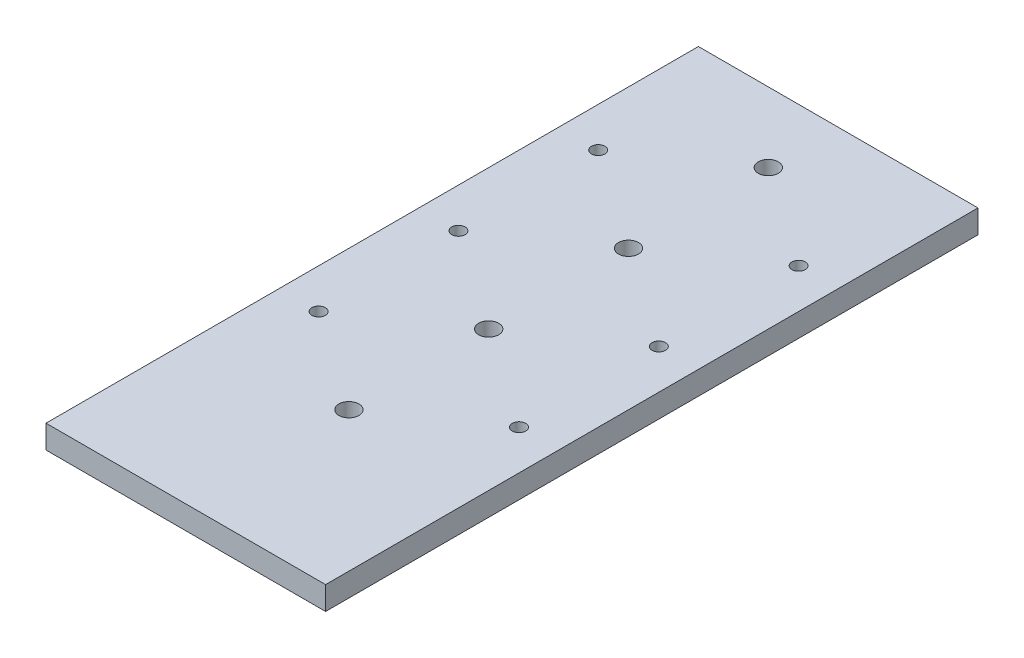
ISO-10303-21;
HEADER;
FILE_DESCRIPTION(('STEP AP214'),'2;1');
FILE_NAME('part.step','',(''),(''),'','','');
FILE_SCHEMA(('AUTOMOTIVE_DESIGN { 1 0 10303 214 1 1 1 1 }'));
ENDSEC;
DATA;
#1=APPLICATION_CONTEXT('core data for automotive mechanical design processes');
#2=APPLICATION_PROTOCOL_DEFINITION('international standard','automotive_design',2000,#1);
#3=PRODUCT_CONTEXT('',#1,'mechanical');
#4=PRODUCT('Part','Part','',(#3));
#5=PRODUCT_RELATED_PRODUCT_CATEGORY('part','',(#4));
#6=PRODUCT_DEFINITION_FORMATION('','',#4);
#7=PRODUCT_DEFINITION_CONTEXT('part definition',#1,'design');
#8=PRODUCT_DEFINITION('design','',#6,#7);
#9=PRODUCT_DEFINITION_SHAPE('','',#8);
#10=(LENGTH_UNIT() NAMED_UNIT(*) SI_UNIT(.MILLI.,.METRE.));
#11=(NAMED_UNIT(*) PLANE_ANGLE_UNIT() SI_UNIT($,.RADIAN.));
#12=(NAMED_UNIT(*) SI_UNIT($,.STERADIAN.) SOLID_ANGLE_UNIT());
#13=UNCERTAINTY_MEASURE_WITH_UNIT(LENGTH_MEASURE(1.E-05),#10,'distance_accuracy_value','');
#14=(GEOMETRIC_REPRESENTATION_CONTEXT(3) GLOBAL_UNCERTAINTY_ASSIGNED_CONTEXT((#13)) GLOBAL_UNIT_ASSIGNED_CONTEXT((#10,
#11,#12)) REPRESENTATION_CONTEXT('',''));
#15=CARTESIAN_POINT('',(0.,0.,0.));
#16=DIRECTION('',(0.,0.,1.));
#17=DIRECTION('',(1.,0.,0.));
#18=AXIS2_PLACEMENT_3D('',#15,#16,#17);
#19=CARTESIAN_POINT('',(38.1,-6.35,-88.9));
#20=DIRECTION('',(1.,0.,0.));
#21=DIRECTION('',(0.,0.,-1.));
#22=AXIS2_PLACEMENT_3D('',#19,#20,#21);
#23=PLANE('',#22);
#24=DIRECTION('',(0.,0.,-1.));
#25=VECTOR('',#24,1.);
#26=CARTESIAN_POINT('',(38.1,0.,-88.9));
#27=LINE('',#26,#25);
#28=CARTESIAN_POINT('',(38.1,0.,88.9));
#29=VERTEX_POINT('',#28);
#30=CARTESIAN_POINT('',(38.1,0.,-88.9));
#31=VERTEX_POINT('',#30);
#32=EDGE_CURVE('E98',#29,#31,#27,.T.);
#33=ORIENTED_EDGE('',*,*,#32,.F.);
#34=DIRECTION('',(0.,1.,0.));
#35=VECTOR('',#34,1.);
#36=CARTESIAN_POINT('',(38.1,-6.35,88.9));
#37=LINE('',#36,#35);
#38=CARTESIAN_POINT('',(38.1,-6.35,88.9));
#39=VERTEX_POINT('',#38);
#40=EDGE_CURVE('E11',#39,#29,#37,.T.);
#41=ORIENTED_EDGE('',*,*,#40,.F.);
#42=DIRECTION('',(0.,0.,-1.));
#43=VECTOR('',#42,1.);
#44=CARTESIAN_POINT('',(38.1,-6.35,-88.9));
#45=LINE('',#44,#43);
#46=CARTESIAN_POINT('',(38.1,-6.35,-88.9));
#47=VERTEX_POINT('',#46);
#48=EDGE_CURVE('E91',#39,#47,#45,.T.);
#49=ORIENTED_EDGE('',*,*,#48,.T.);
#50=DIRECTION('',(0.,1.,0.));
#51=VECTOR('',#50,1.);
#52=CARTESIAN_POINT('',(38.1,-6.35,-88.9));
#53=LINE('',#52,#51);
#54=EDGE_CURVE('E36',#47,#31,#53,.T.);
#55=ORIENTED_EDGE('',*,*,#54,.T.);
#56=EDGE_LOOP('',(#33,#41,#49,#55));
#57=FACE_BOUND('',#56,.T.);
#58=ADVANCED_FACE('F33',(#57),#23,.T.);
#59=CARTESIAN_POINT('',(-38.0999999999999,-6.35,88.9));
#60=DIRECTION('',(0.,0.,1.));
#61=DIRECTION('',(1.,0.,0.));
#62=AXIS2_PLACEMENT_3D('',#59,#60,#61);
#63=PLANE('',#62);
#64=DIRECTION('',(1.,0.,0.));
#65=VECTOR('',#64,1.);
#66=CARTESIAN_POINT('',(-38.0999999999999,0.,88.9));
#67=LINE('',#66,#65);
#68=CARTESIAN_POINT('',(-38.0999999999999,0.,88.9));
#69=VERTEX_POINT('',#68);
#70=EDGE_CURVE('E93',#69,#29,#67,.T.);
#71=ORIENTED_EDGE('',*,*,#70,.F.);
#72=DIRECTION('',(0.,1.,0.));
#73=VECTOR('',#72,1.);
#74=CARTESIAN_POINT('',(-38.0999999999999,-6.35,88.9));
#75=LINE('',#74,#73);
#76=CARTESIAN_POINT('',(-38.0999999999999,-6.35,88.9));
#77=VERTEX_POINT('',#76);
#78=EDGE_CURVE('E42',#77,#69,#75,.T.);
#79=ORIENTED_EDGE('',*,*,#78,.F.);
#80=DIRECTION('',(1.,0.,0.));
#81=VECTOR('',#80,1.);
#82=CARTESIAN_POINT('',(-38.0999999999999,-6.35,88.9));
#83=LINE('',#82,#81);
#84=EDGE_CURVE('E88',#77,#39,#83,.T.);
#85=ORIENTED_EDGE('',*,*,#84,.T.);
#86=ORIENTED_EDGE('',*,*,#40,.T.);
#87=EDGE_LOOP('',(#71,#79,#85,#86));
#88=FACE_BOUND('',#87,.T.);
#89=ADVANCED_FACE('F109',(#88),#63,.T.);
#90=CARTESIAN_POINT('',(-38.1,-6.35,-88.9));
#91=DIRECTION('',(-1.,0.,0.));
#92=DIRECTION('',(0.,0.,1.));
#93=AXIS2_PLACEMENT_3D('',#90,#91,#92);
#94=PLANE('',#93);
#95=DIRECTION('',(0.,0.,1.));
#96=VECTOR('',#95,1.);
#97=CARTESIAN_POINT('',(-38.1,0.,-88.9));
#98=LINE('',#97,#96);
#99=CARTESIAN_POINT('',(-38.1,0.,-88.9));
#100=VERTEX_POINT('',#99);
#101=EDGE_CURVE('E83',#100,#69,#98,.T.);
#102=ORIENTED_EDGE('',*,*,#101,.F.);
#103=DIRECTION('',(0.,1.,0.));
#104=VECTOR('',#103,1.);
#105=CARTESIAN_POINT('',(-38.1,-6.35,-88.9));
#106=LINE('',#105,#104);
#107=CARTESIAN_POINT('',(-38.1,-6.35,-88.9));
#108=VERTEX_POINT('',#107);
#109=EDGE_CURVE('E78',#108,#100,#106,.T.);
#110=ORIENTED_EDGE('',*,*,#109,.F.);
#111=DIRECTION('',(0.,0.,1.));
#112=VECTOR('',#111,1.);
#113=CARTESIAN_POINT('',(-38.1,-6.35,-88.9));
#114=LINE('',#113,#112);
#115=EDGE_CURVE('E81',#108,#77,#114,.T.);
#116=ORIENTED_EDGE('',*,*,#115,.T.);
#117=ORIENTED_EDGE('',*,*,#78,.T.);
#118=EDGE_LOOP('',(#102,#110,#116,#117));
#119=FACE_BOUND('',#118,.T.);
#120=ADVANCED_FACE('F80',(#119),#94,.T.);
#121=CARTESIAN_POINT('',(-38.1,-6.35,-88.9));
#122=DIRECTION('',(0.,0.,-1.));
#123=DIRECTION('',(-1.,0.,0.));
#124=AXIS2_PLACEMENT_3D('',#121,#122,#123);
#125=PLANE('',#124);
#126=DIRECTION('',(-1.,0.,0.));
#127=VECTOR('',#126,1.);
#128=CARTESIAN_POINT('',(-38.1,0.,-88.9));
#129=LINE('',#128,#127);
#130=EDGE_CURVE('E101',#31,#100,#129,.T.);
#131=ORIENTED_EDGE('',*,*,#130,.F.);
#132=ORIENTED_EDGE('',*,*,#54,.F.);
#133=DIRECTION('',(-1.,0.,0.));
#134=VECTOR('',#133,1.);
#135=CARTESIAN_POINT('',(-38.1,-6.35,-88.9));
#136=LINE('',#135,#134);
#137=EDGE_CURVE('E87',#47,#108,#136,.T.);
#138=ORIENTED_EDGE('',*,*,#137,.T.);
#139=ORIENTED_EDGE('',*,*,#109,.T.);
#140=EDGE_LOOP('',(#131,#132,#138,#139));
#141=FACE_BOUND('',#140,.T.);
#142=ADVANCED_FACE('F90',(#141),#125,.T.);
#143=CARTESIAN_POINT('',(0.,-6.35,0.));
#144=DIRECTION('',(0.,1.,0.));
#145=DIRECTION('',(0.,0.,1.));
#146=AXIS2_PLACEMENT_3D('',#143,#144,#145);
#147=PLANE('',#146);
#148=CARTESIAN_POINT('',(-27.305,-6.35,-50.8));
#149=DIRECTION('',(0.,1.,0.));
#150=DIRECTION('',(0.,0.,1.));
#151=AXIS2_PLACEMENT_3D('',#148,#149,#150);
#152=CIRCLE('',#151,1.8288);
#153=CARTESIAN_POINT('',(-27.305,-6.35,-48.9712));
#154=VERTEX_POINT('',#153);
#155=EDGE_CURVE('E174',#154,#154,#152,.T.);
#156=ORIENTED_EDGE('',*,*,#155,.T.);
#157=EDGE_LOOP('',(#156));
#158=FACE_BOUND('',#157,.T.);
#159=CARTESIAN_POINT('',(-27.305,-6.35,25.4));
#160=DIRECTION('',(0.,1.,0.));
#161=DIRECTION('',(0.,0.,1.));
#162=AXIS2_PLACEMENT_3D('',#159,#160,#161);
#163=CIRCLE('',#162,1.8288);
#164=CARTESIAN_POINT('',(-27.305,-6.35,27.2288));
#165=VERTEX_POINT('',#164);
#166=EDGE_CURVE('E182',#165,#165,#163,.T.);
#167=ORIENTED_EDGE('',*,*,#166,.T.);
#168=EDGE_LOOP('',(#167));
#169=FACE_BOUND('',#168,.T.);
#170=CARTESIAN_POINT('',(-27.305,-6.35,-12.7));
#171=DIRECTION('',(0.,1.,0.));
#172=DIRECTION('',(0.,0.,1.));
#173=AXIS2_PLACEMENT_3D('',#170,#171,#172);
#174=CIRCLE('',#173,1.8288);
#175=CARTESIAN_POINT('',(-27.305,-6.35,-10.8712));
#176=VERTEX_POINT('',#175);
#177=EDGE_CURVE('E188',#176,#176,#174,.T.);
#178=ORIENTED_EDGE('',*,*,#177,.T.);
#179=EDGE_LOOP('',(#178));
#180=FACE_BOUND('',#179,.T.);
#181=CARTESIAN_POINT('',(27.305,-6.35,25.4));
#182=DIRECTION('',(0.,1.,0.));
#183=DIRECTION('',(0.,0.,1.));
#184=AXIS2_PLACEMENT_3D('',#181,#182,#183);
#185=CIRCLE('',#184,1.8288);
#186=CARTESIAN_POINT('',(27.305,-6.35,27.2288));
#187=VERTEX_POINT('',#186);
#188=EDGE_CURVE('E194',#187,#187,#185,.T.);
#189=ORIENTED_EDGE('',*,*,#188,.T.);
#190=EDGE_LOOP('',(#189));
#191=FACE_BOUND('',#190,.T.);
#192=CARTESIAN_POINT('',(27.305,-6.35,-12.7));
#193=DIRECTION('',(0.,1.,0.));
#194=DIRECTION('',(0.,0.,1.));
#195=AXIS2_PLACEMENT_3D('',#192,#193,#194);
#196=CIRCLE('',#195,1.8288);
#197=CARTESIAN_POINT('',(27.305,-6.35,-10.8712));
#198=VERTEX_POINT('',#197);
#199=EDGE_CURVE('E200',#198,#198,#196,.T.);
#200=ORIENTED_EDGE('',*,*,#199,.T.);
#201=EDGE_LOOP('',(#200));
#202=FACE_BOUND('',#201,.T.);
#203=CARTESIAN_POINT('',(0.,-6.35,44.45));
#204=DIRECTION('',(0.,1.,0.));
#205=DIRECTION('',(0.,0.,1.));
#206=AXIS2_PLACEMENT_3D('',#203,#204,#205);
#207=CIRCLE('',#206,2.7305);
#208=CARTESIAN_POINT('',(0.,-6.35,47.1805));
#209=VERTEX_POINT('',#208);
#210=EDGE_CURVE('E206',#209,#209,#207,.T.);
#211=ORIENTED_EDGE('',*,*,#210,.T.);
#212=EDGE_LOOP('',(#211));
#213=FACE_BOUND('',#212,.T.);
#214=CARTESIAN_POINT('',(0.,-6.35,6.34999999999998));
#215=DIRECTION('',(0.,1.,0.));
#216=DIRECTION('',(0.,0.,1.));
#217=AXIS2_PLACEMENT_3D('',#214,#215,#216);
#218=CIRCLE('',#217,2.7305);
#219=CARTESIAN_POINT('',(0.,-6.35,9.08049999999998));
#220=VERTEX_POINT('',#219);
#221=EDGE_CURVE('E212',#220,#220,#218,.T.);
#222=ORIENTED_EDGE('',*,*,#221,.T.);
#223=EDGE_LOOP('',(#222));
#224=FACE_BOUND('',#223,.T.);
#225=CARTESIAN_POINT('',(0.,-6.35,-31.75));
#226=DIRECTION('',(0.,1.,0.));
#227=DIRECTION('',(0.,0.,1.));
#228=AXIS2_PLACEMENT_3D('',#225,#226,#227);
#229=CIRCLE('',#228,2.7305);
#230=CARTESIAN_POINT('',(0.,-6.35,-29.0195));
#231=VERTEX_POINT('',#230);
#232=EDGE_CURVE('E218',#231,#231,#229,.T.);
#233=ORIENTED_EDGE('',*,*,#232,.T.);
#234=EDGE_LOOP('',(#233));
#235=FACE_BOUND('',#234,.T.);
#236=CARTESIAN_POINT('',(0.,-6.35,-69.85));
#237=DIRECTION('',(0.,1.,0.));
#238=DIRECTION('',(0.,0.,1.));
#239=AXIS2_PLACEMENT_3D('',#236,#237,#238);
#240=CIRCLE('',#239,2.7305);
#241=CARTESIAN_POINT('',(0.,-6.35,-67.1195));
#242=VERTEX_POINT('',#241);
#243=EDGE_CURVE('E224',#242,#242,#240,.T.);
#244=ORIENTED_EDGE('',*,*,#243,.T.);
#245=EDGE_LOOP('',(#244));
#246=FACE_BOUND('',#245,.T.);
#247=CARTESIAN_POINT('',(27.305,-6.35,-50.8));
#248=DIRECTION('',(0.,1.,0.));
#249=DIRECTION('',(0.,0.,1.));
#250=AXIS2_PLACEMENT_3D('',#247,#248,#249);
#251=CIRCLE('',#250,1.8288);
#252=CARTESIAN_POINT('',(27.305,-6.35,-48.9712));
#253=VERTEX_POINT('',#252);
#254=EDGE_CURVE('E102',#253,#253,#251,.T.);
#255=ORIENTED_EDGE('',*,*,#254,.T.);
#256=EDGE_LOOP('',(#255));
#257=FACE_BOUND('',#256,.T.);
#258=ORIENTED_EDGE('',*,*,#48,.F.);
#259=ORIENTED_EDGE('',*,*,#84,.F.);
#260=ORIENTED_EDGE('',*,*,#115,.F.);
#261=ORIENTED_EDGE('',*,*,#137,.F.);
#262=EDGE_LOOP('',(#258,#259,#260,#261));
#263=FACE_BOUND('',#262,.T.);
#264=ADVANCED_FACE('F86',(#158,#169,#180,#191,#202,#213,#224,#235,#246,#257,#263),#147,.F.);
#265=CARTESIAN_POINT('',(0.,0.,0.));
#266=DIRECTION('',(0.,1.,0.));
#267=DIRECTION('',(0.,0.,1.));
#268=AXIS2_PLACEMENT_3D('',#265,#266,#267);
#269=PLANE('',#268);
#270=CARTESIAN_POINT('',(-27.305,0.,-50.8));
#271=DIRECTION('',(0.,1.,0.));
#272=DIRECTION('',(0.,0.,1.));
#273=AXIS2_PLACEMENT_3D('',#270,#271,#272);
#274=CIRCLE('',#273,1.8288);
#275=CARTESIAN_POINT('',(-27.305,0.,-48.9712));
#276=VERTEX_POINT('',#275);
#277=EDGE_CURVE('E177',#276,#276,#274,.T.);
#278=ORIENTED_EDGE('',*,*,#277,.F.);
#279=EDGE_LOOP('',(#278));
#280=FACE_BOUND('',#279,.T.);
#281=CARTESIAN_POINT('',(-27.305,0.,25.4));
#282=DIRECTION('',(0.,1.,0.));
#283=DIRECTION('',(0.,0.,1.));
#284=AXIS2_PLACEMENT_3D('',#281,#282,#283);
#285=CIRCLE('',#284,1.8288);
#286=CARTESIAN_POINT('',(-27.305,0.,27.2288));
#287=VERTEX_POINT('',#286);
#288=EDGE_CURVE('E179',#287,#287,#285,.T.);
#289=ORIENTED_EDGE('',*,*,#288,.F.);
#290=EDGE_LOOP('',(#289));
#291=FACE_BOUND('',#290,.T.);
#292=CARTESIAN_POINT('',(-27.305,0.,-12.7));
#293=DIRECTION('',(0.,1.,0.));
#294=DIRECTION('',(0.,0.,1.));
#295=AXIS2_PLACEMENT_3D('',#292,#293,#294);
#296=CIRCLE('',#295,1.8288);
#297=CARTESIAN_POINT('',(-27.305,0.,-10.8712));
#298=VERTEX_POINT('',#297);
#299=EDGE_CURVE('E185',#298,#298,#296,.T.);
#300=ORIENTED_EDGE('',*,*,#299,.F.);
#301=EDGE_LOOP('',(#300));
#302=FACE_BOUND('',#301,.T.);
#303=CARTESIAN_POINT('',(27.305,0.,25.4));
#304=DIRECTION('',(0.,1.,0.));
#305=DIRECTION('',(0.,0.,1.));
#306=AXIS2_PLACEMENT_3D('',#303,#304,#305);
#307=CIRCLE('',#306,1.8288);
#308=CARTESIAN_POINT('',(27.305,0.,27.2288));
#309=VERTEX_POINT('',#308);
#310=EDGE_CURVE('E191',#309,#309,#307,.T.);
#311=ORIENTED_EDGE('',*,*,#310,.F.);
#312=EDGE_LOOP('',(#311));
#313=FACE_BOUND('',#312,.T.);
#314=CARTESIAN_POINT('',(27.305,0.,-12.7));
#315=DIRECTION('',(0.,1.,0.));
#316=DIRECTION('',(0.,0.,1.));
#317=AXIS2_PLACEMENT_3D('',#314,#315,#316);
#318=CIRCLE('',#317,1.8288);
#319=CARTESIAN_POINT('',(27.305,0.,-10.8712));
#320=VERTEX_POINT('',#319);
#321=EDGE_CURVE('E197',#320,#320,#318,.T.);
#322=ORIENTED_EDGE('',*,*,#321,.F.);
#323=EDGE_LOOP('',(#322));
#324=FACE_BOUND('',#323,.T.);
#325=CARTESIAN_POINT('',(0.,0.,44.45));
#326=DIRECTION('',(0.,1.,0.));
#327=DIRECTION('',(0.,0.,1.));
#328=AXIS2_PLACEMENT_3D('',#325,#326,#327);
#329=CIRCLE('',#328,2.7305);
#330=CARTESIAN_POINT('',(0.,0.,47.1805));
#331=VERTEX_POINT('',#330);
#332=EDGE_CURVE('E203',#331,#331,#329,.T.);
#333=ORIENTED_EDGE('',*,*,#332,.F.);
#334=EDGE_LOOP('',(#333));
#335=FACE_BOUND('',#334,.T.);
#336=CARTESIAN_POINT('',(0.,0.,6.34999999999998));
#337=DIRECTION('',(0.,1.,0.));
#338=DIRECTION('',(0.,0.,1.));
#339=AXIS2_PLACEMENT_3D('',#336,#337,#338);
#340=CIRCLE('',#339,2.7305);
#341=CARTESIAN_POINT('',(0.,0.,9.08049999999998));
#342=VERTEX_POINT('',#341);
#343=EDGE_CURVE('E209',#342,#342,#340,.T.);
#344=ORIENTED_EDGE('',*,*,#343,.F.);
#345=EDGE_LOOP('',(#344));
#346=FACE_BOUND('',#345,.T.);
#347=CARTESIAN_POINT('',(0.,0.,-31.75));
#348=DIRECTION('',(0.,1.,0.));
#349=DIRECTION('',(0.,0.,1.));
#350=AXIS2_PLACEMENT_3D('',#347,#348,#349);
#351=CIRCLE('',#350,2.7305);
#352=CARTESIAN_POINT('',(0.,0.,-29.0195));
#353=VERTEX_POINT('',#352);
#354=EDGE_CURVE('E215',#353,#353,#351,.T.);
#355=ORIENTED_EDGE('',*,*,#354,.F.);
#356=EDGE_LOOP('',(#355));
#357=FACE_BOUND('',#356,.T.);
#358=CARTESIAN_POINT('',(0.,0.,-69.85));
#359=DIRECTION('',(0.,1.,0.));
#360=DIRECTION('',(0.,0.,1.));
#361=AXIS2_PLACEMENT_3D('',#358,#359,#360);
#362=CIRCLE('',#361,2.7305);
#363=CARTESIAN_POINT('',(0.,0.,-67.1195));
#364=VERTEX_POINT('',#363);
#365=EDGE_CURVE('E221',#364,#364,#362,.T.);
#366=ORIENTED_EDGE('',*,*,#365,.F.);
#367=EDGE_LOOP('',(#366));
#368=FACE_BOUND('',#367,.T.);
#369=CARTESIAN_POINT('',(27.305,0.,-50.8));
#370=DIRECTION('',(0.,1.,0.));
#371=DIRECTION('',(0.,0.,1.));
#372=AXIS2_PLACEMENT_3D('',#369,#370,#371);
#373=CIRCLE('',#372,1.8288);
#374=CARTESIAN_POINT('',(27.305,0.,-48.9712));
#375=VERTEX_POINT('',#374);
#376=EDGE_CURVE('E227',#375,#375,#373,.T.);
#377=ORIENTED_EDGE('',*,*,#376,.F.);
#378=EDGE_LOOP('',(#377));
#379=FACE_BOUND('',#378,.T.);
#380=ORIENTED_EDGE('',*,*,#32,.T.);
#381=ORIENTED_EDGE('',*,*,#130,.T.);
#382=ORIENTED_EDGE('',*,*,#101,.T.);
#383=ORIENTED_EDGE('',*,*,#70,.T.);
#384=EDGE_LOOP('',(#380,#381,#382,#383));
#385=FACE_BOUND('',#384,.T.);
#386=ADVANCED_FACE('F108',(#280,#291,#302,#313,#324,#335,#346,#357,#368,#379,#385),#269,.T.);
#387=CARTESIAN_POINT('',(27.305,-6.35,-50.8));
#388=DIRECTION('',(0.,1.,0.));
#389=DIRECTION('',(0.,0.,1.));
#390=AXIS2_PLACEMENT_3D('',#387,#388,#389);
#391=CYLINDRICAL_SURFACE('',#390,1.8288);
#392=ORIENTED_EDGE('',*,*,#254,.F.);
#393=EDGE_LOOP('',(#392));
#394=FACE_BOUND('',#393,.T.);
#395=ORIENTED_EDGE('',*,*,#376,.T.);
#396=EDGE_LOOP('',(#395));
#397=FACE_BOUND('',#396,.T.);
#398=ADVANCED_FACE('F127',(#394,#397),#391,.F.);
#399=CARTESIAN_POINT('',(0.,-6.35,-69.85));
#400=DIRECTION('',(0.,1.,0.));
#401=DIRECTION('',(0.,0.,1.));
#402=AXIS2_PLACEMENT_3D('',#399,#400,#401);
#403=CYLINDRICAL_SURFACE('',#402,2.7305);
#404=ORIENTED_EDGE('',*,*,#243,.F.);
#405=EDGE_LOOP('',(#404));
#406=FACE_BOUND('',#405,.T.);
#407=ORIENTED_EDGE('',*,*,#365,.T.);
#408=EDGE_LOOP('',(#407));
#409=FACE_BOUND('',#408,.T.);
#410=ADVANCED_FACE('F134',(#406,#409),#403,.F.);
#411=CARTESIAN_POINT('',(0.,-6.35,-31.75));
#412=DIRECTION('',(0.,1.,0.));
#413=DIRECTION('',(0.,0.,1.));
#414=AXIS2_PLACEMENT_3D('',#411,#412,#413);
#415=CYLINDRICAL_SURFACE('',#414,2.7305);
#416=ORIENTED_EDGE('',*,*,#232,.F.);
#417=EDGE_LOOP('',(#416));
#418=FACE_BOUND('',#417,.T.);
#419=ORIENTED_EDGE('',*,*,#354,.T.);
#420=EDGE_LOOP('',(#419));
#421=FACE_BOUND('',#420,.T.);
#422=ADVANCED_FACE('F138',(#418,#421),#415,.F.);
#423=CARTESIAN_POINT('',(0.,-6.35,6.34999999999998));
#424=DIRECTION('',(0.,1.,0.));
#425=DIRECTION('',(0.,0.,1.));
#426=AXIS2_PLACEMENT_3D('',#423,#424,#425);
#427=CYLINDRICAL_SURFACE('',#426,2.7305);
#428=ORIENTED_EDGE('',*,*,#221,.F.);
#429=EDGE_LOOP('',(#428));
#430=FACE_BOUND('',#429,.T.);
#431=ORIENTED_EDGE('',*,*,#343,.T.);
#432=EDGE_LOOP('',(#431));
#433=FACE_BOUND('',#432,.T.);
#434=ADVANCED_FACE('F142',(#430,#433),#427,.F.);
#435=CARTESIAN_POINT('',(0.,-6.35,44.45));
#436=DIRECTION('',(0.,1.,0.));
#437=DIRECTION('',(0.,0.,1.));
#438=AXIS2_PLACEMENT_3D('',#435,#436,#437);
#439=CYLINDRICAL_SURFACE('',#438,2.7305);
#440=ORIENTED_EDGE('',*,*,#210,.F.);
#441=EDGE_LOOP('',(#440));
#442=FACE_BOUND('',#441,.T.);
#443=ORIENTED_EDGE('',*,*,#332,.T.);
#444=EDGE_LOOP('',(#443));
#445=FACE_BOUND('',#444,.T.);
#446=ADVANCED_FACE('F146',(#442,#445),#439,.F.);
#447=CARTESIAN_POINT('',(27.305,-6.35,-12.7));
#448=DIRECTION('',(0.,1.,0.));
#449=DIRECTION('',(0.,0.,1.));
#450=AXIS2_PLACEMENT_3D('',#447,#448,#449);
#451=CYLINDRICAL_SURFACE('',#450,1.8288);
#452=ORIENTED_EDGE('',*,*,#199,.F.);
#453=EDGE_LOOP('',(#452));
#454=FACE_BOUND('',#453,.T.);
#455=ORIENTED_EDGE('',*,*,#321,.T.);
#456=EDGE_LOOP('',(#455));
#457=FACE_BOUND('',#456,.T.);
#458=ADVANCED_FACE('F150',(#454,#457),#451,.F.);
#459=CARTESIAN_POINT('',(27.305,-6.35,25.4));
#460=DIRECTION('',(0.,1.,0.));
#461=DIRECTION('',(0.,0.,1.));
#462=AXIS2_PLACEMENT_3D('',#459,#460,#461);
#463=CYLINDRICAL_SURFACE('',#462,1.8288);
#464=ORIENTED_EDGE('',*,*,#188,.F.);
#465=EDGE_LOOP('',(#464));
#466=FACE_BOUND('',#465,.T.);
#467=ORIENTED_EDGE('',*,*,#310,.T.);
#468=EDGE_LOOP('',(#467));
#469=FACE_BOUND('',#468,.T.);
#470=ADVANCED_FACE('F154',(#466,#469),#463,.F.);
#471=CARTESIAN_POINT('',(-27.305,-6.35,-12.7));
#472=DIRECTION('',(0.,1.,0.));
#473=DIRECTION('',(0.,0.,1.));
#474=AXIS2_PLACEMENT_3D('',#471,#472,#473);
#475=CYLINDRICAL_SURFACE('',#474,1.8288);
#476=ORIENTED_EDGE('',*,*,#177,.F.);
#477=EDGE_LOOP('',(#476));
#478=FACE_BOUND('',#477,.T.);
#479=ORIENTED_EDGE('',*,*,#299,.T.);
#480=EDGE_LOOP('',(#479));
#481=FACE_BOUND('',#480,.T.);
#482=ADVANCED_FACE('F158',(#478,#481),#475,.F.);
#483=CARTESIAN_POINT('',(-27.305,-6.35,25.4));
#484=DIRECTION('',(0.,1.,0.));
#485=DIRECTION('',(0.,0.,1.));
#486=AXIS2_PLACEMENT_3D('',#483,#484,#485);
#487=CYLINDRICAL_SURFACE('',#486,1.8288);
#488=ORIENTED_EDGE('',*,*,#166,.F.);
#489=EDGE_LOOP('',(#488));
#490=FACE_BOUND('',#489,.T.);
#491=ORIENTED_EDGE('',*,*,#288,.T.);
#492=EDGE_LOOP('',(#491));
#493=FACE_BOUND('',#492,.T.);
#494=ADVANCED_FACE('F162',(#490,#493),#487,.F.);
#495=CARTESIAN_POINT('',(-27.305,-6.35,-50.8));
#496=DIRECTION('',(0.,1.,0.));
#497=DIRECTION('',(0.,0.,1.));
#498=AXIS2_PLACEMENT_3D('',#495,#496,#497);
#499=CYLINDRICAL_SURFACE('',#498,1.8288);
#500=ORIENTED_EDGE('',*,*,#155,.F.);
#501=EDGE_LOOP('',(#500));
#502=FACE_BOUND('',#501,.T.);
#503=ORIENTED_EDGE('',*,*,#277,.T.);
#504=EDGE_LOOP('',(#503));
#505=FACE_BOUND('',#504,.T.);
#506=ADVANCED_FACE('F166',(#502,#505),#499,.F.);
#507=CLOSED_SHELL('',(#58,#89,#120,#142,#264,#386,#398,#410,#422,#434,#446,#458,#470,#482,#494,#506));
#508=MANIFOLD_SOLID_BREP('B2',#507);
#509=ADVANCED_BREP_SHAPE_REPRESENTATION('',(#18,#508),#14);
#510=SHAPE_DEFINITION_REPRESENTATION(#9,#509);
ENDSEC;
END-ISO-10303-21;
